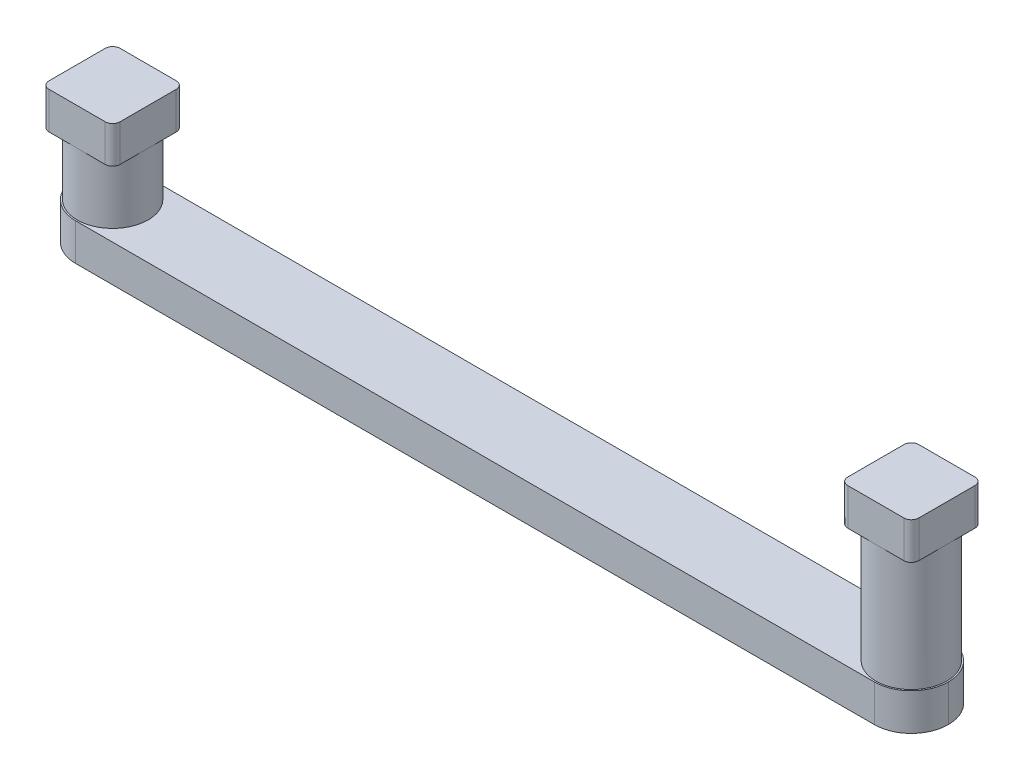
ISO-10303-21;
HEADER;
FILE_DESCRIPTION(('STEP AP214'),'2;1');
FILE_NAME('part.step','',(''),(''),'','','');
FILE_SCHEMA(('AUTOMOTIVE_DESIGN { 1 0 10303 214 1 1 1 1 }'));
ENDSEC;
DATA;
#1=APPLICATION_CONTEXT('core data for automotive mechanical design processes');
#2=APPLICATION_PROTOCOL_DEFINITION('international standard','automotive_design',2000,#1);
#3=PRODUCT_CONTEXT('',#1,'mechanical');
#4=PRODUCT('Part','Part','',(#3));
#5=PRODUCT_RELATED_PRODUCT_CATEGORY('part','',(#4));
#6=PRODUCT_DEFINITION_FORMATION('','',#4);
#7=PRODUCT_DEFINITION_CONTEXT('part definition',#1,'design');
#8=PRODUCT_DEFINITION('design','',#6,#7);
#9=PRODUCT_DEFINITION_SHAPE('','',#8);
#10=(LENGTH_UNIT() NAMED_UNIT(*) SI_UNIT(.MILLI.,.METRE.));
#11=(NAMED_UNIT(*) PLANE_ANGLE_UNIT() SI_UNIT($,.RADIAN.));
#12=(NAMED_UNIT(*) SI_UNIT($,.STERADIAN.) SOLID_ANGLE_UNIT());
#13=UNCERTAINTY_MEASURE_WITH_UNIT(LENGTH_MEASURE(1.E-05),#10,'distance_accuracy_value','');
#14=(GEOMETRIC_REPRESENTATION_CONTEXT(3) GLOBAL_UNCERTAINTY_ASSIGNED_CONTEXT((#13)) GLOBAL_UNIT_ASSIGNED_CONTEXT((#10,
#11,#12)) REPRESENTATION_CONTEXT('',''));
#15=CARTESIAN_POINT('',(0.,0.,0.));
#16=DIRECTION('',(0.,0.,1.));
#17=DIRECTION('',(1.,0.,0.));
#18=AXIS2_PLACEMENT_3D('',#15,#16,#17);
#19=CARTESIAN_POINT('',(37.465,3.175,3.17499999999999));
#20=DIRECTION('',(0.,0.,-1.));
#21=DIRECTION('',(-1.,0.,0.));
#22=AXIS2_PLACEMENT_3D('',#19,#20,#21);
#23=PLANE('',#22);
#24=DIRECTION('',(1.,0.,0.));
#25=VECTOR('',#24,1.);
#26=CARTESIAN_POINT('',(37.465,3.175,3.17499999999999));
#27=LINE('',#26,#25);
#28=CARTESIAN_POINT('',(-34.29,3.175,3.175));
#29=VERTEX_POINT('',#28);
#30=CARTESIAN_POINT('',(34.29,3.175,3.175));
#31=VERTEX_POINT('',#30);
#32=EDGE_CURVE('E285',#29,#31,#27,.T.);
#33=ORIENTED_EDGE('',*,*,#32,.F.);
#34=DIRECTION('',(0.,-1.,0.));
#35=VECTOR('',#34,1.);
#36=CARTESIAN_POINT('',(-34.29,3.175,3.175));
#37=LINE('',#36,#35);
#38=CARTESIAN_POINT('',(-34.29,0.,3.175));
#39=VERTEX_POINT('',#38);
#40=EDGE_CURVE('E365',#29,#39,#37,.T.);
#41=ORIENTED_EDGE('',*,*,#40,.T.);
#42=DIRECTION('',(1.,0.,0.));
#43=VECTOR('',#42,1.);
#44=CARTESIAN_POINT('',(37.465,0.,3.17499999999999));
#45=LINE('',#44,#43);
#46=CARTESIAN_POINT('',(34.29,0.,3.175));
#47=VERTEX_POINT('',#46);
#48=EDGE_CURVE('E280',#39,#47,#45,.T.);
#49=ORIENTED_EDGE('',*,*,#48,.T.);
#50=DIRECTION('',(0.,-1.,0.));
#51=VECTOR('',#50,1.);
#52=CARTESIAN_POINT('',(34.29,3.175,3.175));
#53=LINE('',#52,#51);
#54=EDGE_CURVE('E363',#47,#31,#53,.F.);
#55=ORIENTED_EDGE('',*,*,#54,.T.);
#56=EDGE_LOOP('',(#33,#41,#49,#55));
#57=FACE_BOUND('',#56,.T.);
#58=ADVANCED_FACE('F33',(#57),#23,.F.);
#59=CARTESIAN_POINT('',(37.465,3.175,-3.175));
#60=DIRECTION('',(0.,0.,1.));
#61=DIRECTION('',(1.,0.,0.));
#62=AXIS2_PLACEMENT_3D('',#59,#60,#61);
#63=PLANE('',#62);
#64=DIRECTION('',(-1.,0.,0.));
#65=VECTOR('',#64,1.);
#66=CARTESIAN_POINT('',(37.465,0.,-3.175));
#67=LINE('',#66,#65);
#68=CARTESIAN_POINT('',(34.29,0.,-3.175));
#69=VERTEX_POINT('',#68);
#70=CARTESIAN_POINT('',(-34.29,0.,-3.175));
#71=VERTEX_POINT('',#70);
#72=EDGE_CURVE('E289',#69,#71,#67,.T.);
#73=ORIENTED_EDGE('',*,*,#72,.T.);
#74=DIRECTION('',(0.,-1.,0.));
#75=VECTOR('',#74,1.);
#76=CARTESIAN_POINT('',(-34.29,3.175,-3.175));
#77=LINE('',#76,#75);
#78=CARTESIAN_POINT('',(-34.29,3.175,-3.175));
#79=VERTEX_POINT('',#78);
#80=EDGE_CURVE('E11',#71,#79,#77,.F.);
#81=ORIENTED_EDGE('',*,*,#80,.T.);
#82=DIRECTION('',(-1.,0.,0.));
#83=VECTOR('',#82,1.);
#84=CARTESIAN_POINT('',(37.465,3.175,-3.175));
#85=LINE('',#84,#83);
#86=CARTESIAN_POINT('',(34.29,3.175,-3.175));
#87=VERTEX_POINT('',#86);
#88=EDGE_CURVE('E288',#87,#79,#85,.T.);
#89=ORIENTED_EDGE('',*,*,#88,.F.);
#90=DIRECTION('',(0.,-1.,0.));
#91=VECTOR('',#90,1.);
#92=CARTESIAN_POINT('',(34.29,3.175,-3.175));
#93=LINE('',#92,#91);
#94=EDGE_CURVE('E42',#87,#69,#93,.T.);
#95=ORIENTED_EDGE('',*,*,#94,.T.);
#96=EDGE_LOOP('',(#73,#81,#89,#95));
#97=FACE_BOUND('',#96,.T.);
#98=ADVANCED_FACE('F415',(#97),#63,.F.);
#99=CARTESIAN_POINT('',(0.,3.175,0.));
#100=DIRECTION('',(0.,1.,0.));
#101=DIRECTION('',(0.,0.,1.));
#102=AXIS2_PLACEMENT_3D('',#99,#100,#101);
#103=PLANE('',#102);
#104=CARTESIAN_POINT('',(34.29,3.175,0.));
#105=DIRECTION('',(0.,1.,0.));
#106=DIRECTION('',(0.,0.,1.));
#107=AXIS2_PLACEMENT_3D('',#104,#105,#106);
#108=CIRCLE('',#107,3.048);
#109=CARTESIAN_POINT('',(34.29,3.175,3.048));
#110=VERTEX_POINT('',#109);
#111=EDGE_CURVE('E243',#110,#110,#108,.T.);
#112=ORIENTED_EDGE('',*,*,#111,.F.);
#113=EDGE_LOOP('',(#112));
#114=FACE_BOUND('',#113,.T.);
#115=CARTESIAN_POINT('',(-34.29,3.175,0.));
#116=DIRECTION('',(0.,1.,0.));
#117=DIRECTION('',(0.,0.,1.));
#118=AXIS2_PLACEMENT_3D('',#115,#116,#117);
#119=CIRCLE('',#118,3.048);
#120=CARTESIAN_POINT('',(-34.29,3.175,3.04800000000001));
#121=VERTEX_POINT('',#120);
#122=EDGE_CURVE('E266',#121,#121,#119,.T.);
#123=ORIENTED_EDGE('',*,*,#122,.F.);
#124=EDGE_LOOP('',(#123));
#125=FACE_BOUND('',#124,.T.);
#126=CARTESIAN_POINT('',(-34.29,3.175,0.));
#127=DIRECTION('',(0.,1.,0.));
#128=DIRECTION('',(0.,0.,1.));
#129=AXIS2_PLACEMENT_3D('',#126,#127,#128);
#130=CIRCLE('',#129,3.175);
#131=CARTESIAN_POINT('',(-37.465,3.175,0.));
#132=VERTEX_POINT('',#131);
#133=EDGE_CURVE('E379',#79,#132,#130,.T.);
#134=ORIENTED_EDGE('',*,*,#133,.T.);
#135=CARTESIAN_POINT('',(-34.29,3.175,0.));
#136=DIRECTION('',(0.,1.,0.));
#137=DIRECTION('',(0.,0.,1.));
#138=AXIS2_PLACEMENT_3D('',#135,#136,#137);
#139=CIRCLE('',#138,3.175);
#140=EDGE_CURVE('E381',#132,#29,#139,.T.);
#141=ORIENTED_EDGE('',*,*,#140,.T.);
#142=ORIENTED_EDGE('',*,*,#32,.T.);
#143=CARTESIAN_POINT('',(34.29,3.175,0.));
#144=DIRECTION('',(0.,1.,0.));
#145=DIRECTION('',(0.,0.,1.));
#146=AXIS2_PLACEMENT_3D('',#143,#144,#145);
#147=CIRCLE('',#146,3.175);
#148=CARTESIAN_POINT('',(37.465,3.175,0.));
#149=VERTEX_POINT('',#148);
#150=EDGE_CURVE('E376',#31,#149,#147,.T.);
#151=ORIENTED_EDGE('',*,*,#150,.T.);
#152=CARTESIAN_POINT('',(34.29,3.175,0.));
#153=DIRECTION('',(0.,1.,0.));
#154=DIRECTION('',(0.,0.,1.));
#155=AXIS2_PLACEMENT_3D('',#152,#153,#154);
#156=CIRCLE('',#155,3.175);
#157=EDGE_CURVE('E55',#149,#87,#156,.T.);
#158=ORIENTED_EDGE('',*,*,#157,.T.);
#159=ORIENTED_EDGE('',*,*,#88,.T.);
#160=EDGE_LOOP('',(#134,#141,#142,#151,#158,#159));
#161=FACE_BOUND('',#160,.T.);
#162=ADVANCED_FACE('F414',(#114,#125,#161),#103,.T.);
#163=CARTESIAN_POINT('',(0.,0.,0.));
#164=DIRECTION('',(0.,1.,0.));
#165=DIRECTION('',(0.,0.,1.));
#166=AXIS2_PLACEMENT_3D('',#163,#164,#165);
#167=PLANE('',#166);
#168=ORIENTED_EDGE('',*,*,#48,.F.);
#169=CARTESIAN_POINT('',(-34.29,0.,0.));
#170=DIRECTION('',(0.,1.,0.));
#171=DIRECTION('',(0.,0.,1.));
#172=AXIS2_PLACEMENT_3D('',#169,#170,#171);
#173=CIRCLE('',#172,3.175);
#174=CARTESIAN_POINT('',(-37.465,0.,0.));
#175=VERTEX_POINT('',#174);
#176=EDGE_CURVE('E374',#39,#175,#173,.F.);
#177=ORIENTED_EDGE('',*,*,#176,.T.);
#178=CARTESIAN_POINT('',(-34.29,0.,0.));
#179=DIRECTION('',(0.,1.,0.));
#180=DIRECTION('',(0.,0.,1.));
#181=AXIS2_PLACEMENT_3D('',#178,#179,#180);
#182=CIRCLE('',#181,3.175);
#183=EDGE_CURVE('E372',#175,#71,#182,.F.);
#184=ORIENTED_EDGE('',*,*,#183,.T.);
#185=ORIENTED_EDGE('',*,*,#72,.F.);
#186=CARTESIAN_POINT('',(34.29,0.,0.));
#187=DIRECTION('',(0.,1.,0.));
#188=DIRECTION('',(0.,0.,1.));
#189=AXIS2_PLACEMENT_3D('',#186,#187,#188);
#190=CIRCLE('',#189,3.175);
#191=CARTESIAN_POINT('',(37.465,0.,0.));
#192=VERTEX_POINT('',#191);
#193=EDGE_CURVE('E370',#69,#192,#190,.F.);
#194=ORIENTED_EDGE('',*,*,#193,.T.);
#195=CARTESIAN_POINT('',(34.29,0.,0.));
#196=DIRECTION('',(0.,1.,0.));
#197=DIRECTION('',(0.,0.,1.));
#198=AXIS2_PLACEMENT_3D('',#195,#196,#197);
#199=CIRCLE('',#198,3.175);
#200=EDGE_CURVE('E368',#192,#47,#199,.F.);
#201=ORIENTED_EDGE('',*,*,#200,.T.);
#202=EDGE_LOOP('',(#168,#177,#184,#185,#194,#201));
#203=FACE_BOUND('',#202,.T.);
#204=ADVANCED_FACE('F404',(#203),#167,.F.);
#205=CARTESIAN_POINT('',(-34.29,8.509,0.));
#206=DIRECTION('',(0.,-1.,0.));
#207=DIRECTION('',(0.,0.,-1.));
#208=AXIS2_PLACEMENT_3D('',#205,#206,#207);
#209=CYLINDRICAL_SURFACE('',#208,3.048);
#210=CARTESIAN_POINT('',(-34.29,8.509,0.));
#211=DIRECTION('',(0.,1.,0.));
#212=DIRECTION('',(0.,0.,1.));
#213=AXIS2_PLACEMENT_3D('',#210,#211,#212);
#214=CIRCLE('',#213,3.048);
#215=CARTESIAN_POINT('',(-34.29,8.509,3.04800000000001));
#216=VERTEX_POINT('',#215);
#217=CARTESIAN_POINT('',(-31.242,8.509,0.));
#218=VERTEX_POINT('',#217);
#219=EDGE_CURVE('E277',#216,#218,#214,.T.);
#220=ORIENTED_EDGE('',*,*,#219,.F.);
#221=CARTESIAN_POINT('',(-37.338,8.509,0.));
#222=VERTEX_POINT('',#221);
#223=EDGE_CURVE('E282',#222,#216,#214,.T.);
#224=ORIENTED_EDGE('',*,*,#223,.F.);
#225=CARTESIAN_POINT('',(-34.29,8.509,-3.048));
#226=VERTEX_POINT('',#225);
#227=EDGE_CURVE('E761',#226,#222,#214,.T.);
#228=ORIENTED_EDGE('',*,*,#227,.F.);
#229=EDGE_CURVE('E281',#218,#226,#214,.T.);
#230=ORIENTED_EDGE('',*,*,#229,.F.);
#231=EDGE_LOOP('',(#220,#224,#228,#230));
#232=FACE_BOUND('',#231,.T.);
#233=ORIENTED_EDGE('',*,*,#122,.T.);
#234=EDGE_LOOP('',(#233));
#235=FACE_BOUND('',#234,.T.);
#236=ADVANCED_FACE('F649',(#232,#235),#209,.T.);
#237=CARTESIAN_POINT('',(0.,8.509,0.));
#238=DIRECTION('',(0.,1.,0.));
#239=DIRECTION('',(0.,0.,1.));
#240=AXIS2_PLACEMENT_3D('',#237,#238,#239);
#241=PLANE('',#240);
#242=DIRECTION('',(0.,0.,-1.));
#243=VECTOR('',#242,1.);
#244=CARTESIAN_POINT('',(-31.242,8.509,3.04800000000001));
#245=LINE('',#244,#243);
#246=CARTESIAN_POINT('',(-31.242,8.509,2.41300000000001));
#247=VERTEX_POINT('',#246);
#248=EDGE_CURVE('E273',#247,#218,#245,.T.);
#249=ORIENTED_EDGE('',*,*,#248,.F.);
#250=CARTESIAN_POINT('',(-31.877,8.509,2.41300000000001));
#251=DIRECTION('',(0.,1.,0.));
#252=DIRECTION('',(0.,0.,1.));
#253=AXIS2_PLACEMENT_3D('',#250,#251,#252);
#254=CIRCLE('',#253,0.635);
#255=CARTESIAN_POINT('',(-31.877,8.509,3.04800000000001));
#256=VERTEX_POINT('',#255);
#257=EDGE_CURVE('E352',#247,#256,#254,.F.);
#258=ORIENTED_EDGE('',*,*,#257,.T.);
#259=DIRECTION('',(1.,0.,0.));
#260=VECTOR('',#259,1.);
#261=CARTESIAN_POINT('',(-31.242,8.509,3.04800000000001));
#262=LINE('',#261,#260);
#263=EDGE_CURVE('E269',#216,#256,#262,.T.);
#264=ORIENTED_EDGE('',*,*,#263,.F.);
#265=ORIENTED_EDGE('',*,*,#219,.T.);
#266=EDGE_LOOP('',(#249,#258,#264,#265));
#267=FACE_BOUND('',#266,.T.);
#268=ADVANCED_FACE('F631',(#267),#241,.F.);
#269=DIRECTION('',(-1.,0.,0.));
#270=VECTOR('',#269,1.);
#271=CARTESIAN_POINT('',(-31.242,8.509,-3.048));
#272=LINE('',#271,#270);
#273=CARTESIAN_POINT('',(-31.877,8.509,-3.048));
#274=VERTEX_POINT('',#273);
#275=EDGE_CURVE('E257',#274,#226,#272,.T.);
#276=ORIENTED_EDGE('',*,*,#275,.F.);
#277=CARTESIAN_POINT('',(-31.877,8.509,-2.413));
#278=DIRECTION('',(0.,1.,0.));
#279=DIRECTION('',(0.,0.,1.));
#280=AXIS2_PLACEMENT_3D('',#277,#278,#279);
#281=CIRCLE('',#280,0.635);
#282=CARTESIAN_POINT('',(-31.242,8.509,-2.413));
#283=VERTEX_POINT('',#282);
#284=EDGE_CURVE('E361',#274,#283,#281,.F.);
#285=ORIENTED_EDGE('',*,*,#284,.T.);
#286=EDGE_CURVE('E272',#218,#283,#245,.T.);
#287=ORIENTED_EDGE('',*,*,#286,.F.);
#288=ORIENTED_EDGE('',*,*,#229,.T.);
#289=EDGE_LOOP('',(#276,#285,#287,#288));
#290=FACE_BOUND('',#289,.T.);
#291=ADVANCED_FACE('F637',(#290),#241,.F.);
#292=DIRECTION('',(0.,0.,1.));
#293=VECTOR('',#292,1.);
#294=CARTESIAN_POINT('',(-37.338,8.509,3.04800000000001));
#295=LINE('',#294,#293);
#296=CARTESIAN_POINT('',(-37.338,8.509,-2.413));
#297=VERTEX_POINT('',#296);
#298=EDGE_CURVE('E267',#297,#222,#295,.T.);
#299=ORIENTED_EDGE('',*,*,#298,.F.);
#300=CARTESIAN_POINT('',(-36.703,8.509,-2.413));
#301=DIRECTION('',(0.,1.,0.));
#302=DIRECTION('',(0.,0.,1.));
#303=AXIS2_PLACEMENT_3D('',#300,#301,#302);
#304=CIRCLE('',#303,0.635);
#305=CARTESIAN_POINT('',(-36.703,8.509,-3.048));
#306=VERTEX_POINT('',#305);
#307=EDGE_CURVE('E354',#297,#306,#304,.F.);
#308=ORIENTED_EDGE('',*,*,#307,.T.);
#309=EDGE_CURVE('E275',#226,#306,#272,.T.);
#310=ORIENTED_EDGE('',*,*,#309,.F.);
#311=ORIENTED_EDGE('',*,*,#227,.T.);
#312=EDGE_LOOP('',(#299,#308,#310,#311));
#313=FACE_BOUND('',#312,.T.);
#314=ADVANCED_FACE('F628',(#313),#241,.F.);
#315=CARTESIAN_POINT('',(-36.703,8.509,3.04800000000001));
#316=VERTEX_POINT('',#315);
#317=EDGE_CURVE('E270',#316,#216,#262,.T.);
#318=ORIENTED_EDGE('',*,*,#317,.F.);
#319=CARTESIAN_POINT('',(-36.703,8.509,2.41300000000001));
#320=DIRECTION('',(0.,1.,0.));
#321=DIRECTION('',(0.,0.,1.));
#322=AXIS2_PLACEMENT_3D('',#319,#320,#321);
#323=CIRCLE('',#322,0.635);
#324=CARTESIAN_POINT('',(-37.338,8.509,2.41300000000001));
#325=VERTEX_POINT('',#324);
#326=EDGE_CURVE('E332',#316,#325,#323,.F.);
#327=ORIENTED_EDGE('',*,*,#326,.T.);
#328=EDGE_CURVE('E236',#222,#325,#295,.T.);
#329=ORIENTED_EDGE('',*,*,#328,.F.);
#330=ORIENTED_EDGE('',*,*,#223,.T.);
#331=EDGE_LOOP('',(#318,#327,#329,#330));
#332=FACE_BOUND('',#331,.T.);
#333=ADVANCED_FACE('F620',(#332),#241,.F.);
#334=CARTESIAN_POINT('',(-37.338,11.684,3.04800000000001));
#335=DIRECTION('',(1.,0.,0.));
#336=DIRECTION('',(0.,0.,-1.));
#337=AXIS2_PLACEMENT_3D('',#334,#335,#336);
#338=PLANE('',#337);
#339=ORIENTED_EDGE('',*,*,#328,.T.);
#340=DIRECTION('',(0.,-1.,0.));
#341=VECTOR('',#340,1.);
#342=CARTESIAN_POINT('',(-37.338,11.684,2.41300000000001));
#343=LINE('',#342,#341);
#344=CARTESIAN_POINT('',(-37.338,11.684,2.41300000000001));
#345=VERTEX_POINT('',#344);
#346=EDGE_CURVE('E337',#325,#345,#343,.F.);
#347=ORIENTED_EDGE('',*,*,#346,.T.);
#348=DIRECTION('',(0.,0.,1.));
#349=VECTOR('',#348,1.);
#350=CARTESIAN_POINT('',(-37.338,11.684,3.04800000000001));
#351=LINE('',#350,#349);
#352=CARTESIAN_POINT('',(-37.338,11.684,-2.413));
#353=VERTEX_POINT('',#352);
#354=EDGE_CURVE('E253',#353,#345,#351,.T.);
#355=ORIENTED_EDGE('',*,*,#354,.F.);
#356=DIRECTION('',(0.,-1.,0.));
#357=VECTOR('',#356,1.);
#358=CARTESIAN_POINT('',(-37.338,11.684,-2.413));
#359=LINE('',#358,#357);
#360=EDGE_CURVE('E334',#353,#297,#359,.T.);
#361=ORIENTED_EDGE('',*,*,#360,.T.);
#362=ORIENTED_EDGE('',*,*,#298,.T.);
#363=EDGE_LOOP('',(#339,#347,#355,#361,#362));
#364=FACE_BOUND('',#363,.T.);
#365=ADVANCED_FACE('F612',(#364),#338,.F.);
#366=CARTESIAN_POINT('',(-31.242,11.684,3.04800000000001));
#367=DIRECTION('',(0.,0.,-1.));
#368=DIRECTION('',(-1.,0.,0.));
#369=AXIS2_PLACEMENT_3D('',#366,#367,#368);
#370=PLANE('',#369);
#371=DIRECTION('',(1.,0.,0.));
#372=VECTOR('',#371,1.);
#373=CARTESIAN_POINT('',(-31.242,11.684,3.04800000000001));
#374=LINE('',#373,#372);
#375=CARTESIAN_POINT('',(-36.703,11.684,3.04800000000001));
#376=VERTEX_POINT('',#375);
#377=CARTESIAN_POINT('',(-31.877,11.684,3.04800000000001));
#378=VERTEX_POINT('',#377);
#379=EDGE_CURVE('E256',#376,#378,#374,.T.);
#380=ORIENTED_EDGE('',*,*,#379,.F.);
#381=DIRECTION('',(0.,-1.,0.));
#382=VECTOR('',#381,1.);
#383=CARTESIAN_POINT('',(-36.703,11.684,3.04800000000001));
#384=LINE('',#383,#382);
#385=EDGE_CURVE('E329',#376,#316,#384,.T.);
#386=ORIENTED_EDGE('',*,*,#385,.T.);
#387=ORIENTED_EDGE('',*,*,#317,.T.);
#388=ORIENTED_EDGE('',*,*,#263,.T.);
#389=DIRECTION('',(0.,-1.,0.));
#390=VECTOR('',#389,1.);
#391=CARTESIAN_POINT('',(-31.877,11.684,3.04800000000001));
#392=LINE('',#391,#390);
#393=EDGE_CURVE('E327',#256,#378,#392,.F.);
#394=ORIENTED_EDGE('',*,*,#393,.T.);
#395=EDGE_LOOP('',(#380,#386,#387,#388,#394));
#396=FACE_BOUND('',#395,.T.);
#397=ADVANCED_FACE('F604',(#396),#370,.F.);
#398=CARTESIAN_POINT('',(-31.242,11.684,3.04800000000001));
#399=DIRECTION('',(-1.,0.,0.));
#400=DIRECTION('',(0.,0.,1.));
#401=AXIS2_PLACEMENT_3D('',#398,#399,#400);
#402=PLANE('',#401);
#403=DIRECTION('',(0.,0.,-1.));
#404=VECTOR('',#403,1.);
#405=CARTESIAN_POINT('',(-31.242,11.684,3.04800000000001));
#406=LINE('',#405,#404);
#407=CARTESIAN_POINT('',(-31.242,11.684,2.41300000000001));
#408=VERTEX_POINT('',#407);
#409=CARTESIAN_POINT('',(-31.242,11.684,-2.413));
#410=VERTEX_POINT('',#409);
#411=EDGE_CURVE('E260',#408,#410,#406,.T.);
#412=ORIENTED_EDGE('',*,*,#411,.F.);
#413=DIRECTION('',(0.,-1.,0.));
#414=VECTOR('',#413,1.);
#415=CARTESIAN_POINT('',(-31.242,11.684,2.41300000000001));
#416=LINE('',#415,#414);
#417=EDGE_CURVE('E349',#408,#247,#416,.T.);
#418=ORIENTED_EDGE('',*,*,#417,.T.);
#419=ORIENTED_EDGE('',*,*,#248,.T.);
#420=ORIENTED_EDGE('',*,*,#286,.T.);
#421=DIRECTION('',(0.,-1.,0.));
#422=VECTOR('',#421,1.);
#423=CARTESIAN_POINT('',(-31.242,11.684,-2.413));
#424=LINE('',#423,#422);
#425=EDGE_CURVE('E347',#283,#410,#424,.F.);
#426=ORIENTED_EDGE('',*,*,#425,.T.);
#427=EDGE_LOOP('',(#412,#418,#419,#420,#426));
#428=FACE_BOUND('',#427,.T.);
#429=ADVANCED_FACE('F596',(#428),#402,.F.);
#430=CARTESIAN_POINT('',(-31.242,11.684,-3.048));
#431=DIRECTION('',(0.,0.,1.));
#432=DIRECTION('',(1.,0.,0.));
#433=AXIS2_PLACEMENT_3D('',#430,#431,#432);
#434=PLANE('',#433);
#435=ORIENTED_EDGE('',*,*,#309,.T.);
#436=DIRECTION('',(0.,-1.,0.));
#437=VECTOR('',#436,1.);
#438=CARTESIAN_POINT('',(-36.703,11.684,-3.048));
#439=LINE('',#438,#437);
#440=CARTESIAN_POINT('',(-36.703,11.684,-3.048));
#441=VERTEX_POINT('',#440);
#442=EDGE_CURVE('E359',#306,#441,#439,.F.);
#443=ORIENTED_EDGE('',*,*,#442,.T.);
#444=DIRECTION('',(-1.,0.,0.));
#445=VECTOR('',#444,1.);
#446=CARTESIAN_POINT('',(-31.242,11.684,-3.048));
#447=LINE('',#446,#445);
#448=CARTESIAN_POINT('',(-31.877,11.684,-3.048));
#449=VERTEX_POINT('',#448);
#450=EDGE_CURVE('E263',#449,#441,#447,.T.);
#451=ORIENTED_EDGE('',*,*,#450,.F.);
#452=DIRECTION('',(0.,-1.,0.));
#453=VECTOR('',#452,1.);
#454=CARTESIAN_POINT('',(-31.877,11.684,-3.048));
#455=LINE('',#454,#453);
#456=EDGE_CURVE('E356',#449,#274,#455,.T.);
#457=ORIENTED_EDGE('',*,*,#456,.T.);
#458=ORIENTED_EDGE('',*,*,#275,.T.);
#459=EDGE_LOOP('',(#435,#443,#451,#457,#458));
#460=FACE_BOUND('',#459,.T.);
#461=ADVANCED_FACE('F588',(#460),#434,.F.);
#462=CARTESIAN_POINT('',(0.,11.684,0.));
#463=DIRECTION('',(0.,1.,0.));
#464=DIRECTION('',(0.,0.,1.));
#465=AXIS2_PLACEMENT_3D('',#462,#463,#464);
#466=PLANE('',#465);
#467=ORIENTED_EDGE('',*,*,#354,.T.);
#468=CARTESIAN_POINT('',(-36.703,11.684,2.41300000000001));
#469=DIRECTION('',(0.,1.,0.));
#470=DIRECTION('',(0.,0.,1.));
#471=AXIS2_PLACEMENT_3D('',#468,#469,#470);
#472=CIRCLE('',#471,0.635);
#473=EDGE_CURVE('E345',#345,#376,#472,.T.);
#474=ORIENTED_EDGE('',*,*,#473,.T.);
#475=ORIENTED_EDGE('',*,*,#379,.T.);
#476=CARTESIAN_POINT('',(-31.877,11.684,2.41300000000001));
#477=DIRECTION('',(0.,1.,0.));
#478=DIRECTION('',(0.,0.,1.));
#479=AXIS2_PLACEMENT_3D('',#476,#477,#478);
#480=CIRCLE('',#479,0.635);
#481=EDGE_CURVE('E343',#378,#408,#480,.T.);
#482=ORIENTED_EDGE('',*,*,#481,.T.);
#483=ORIENTED_EDGE('',*,*,#411,.T.);
#484=CARTESIAN_POINT('',(-31.877,11.684,-2.413));
#485=DIRECTION('',(0.,1.,0.));
#486=DIRECTION('',(0.,0.,1.));
#487=AXIS2_PLACEMENT_3D('',#484,#485,#486);
#488=CIRCLE('',#487,0.635);
#489=EDGE_CURVE('E339',#410,#449,#488,.T.);
#490=ORIENTED_EDGE('',*,*,#489,.T.);
#491=ORIENTED_EDGE('',*,*,#450,.T.);
#492=CARTESIAN_POINT('',(-36.703,11.684,-2.413));
#493=DIRECTION('',(0.,1.,0.));
#494=DIRECTION('',(0.,0.,1.));
#495=AXIS2_PLACEMENT_3D('',#492,#493,#494);
#496=CIRCLE('',#495,0.635);
#497=EDGE_CURVE('E341',#441,#353,#496,.T.);
#498=ORIENTED_EDGE('',*,*,#497,.T.);
#499=EDGE_LOOP('',(#467,#474,#475,#482,#483,#490,#491,#498));
#500=FACE_BOUND('',#499,.T.);
#501=ADVANCED_FACE('F580',(#500),#466,.T.);
#502=CARTESIAN_POINT('',(34.29,13.335,0.));
#503=DIRECTION('',(0.,-1.,0.));
#504=DIRECTION('',(0.,0.,-1.));
#505=AXIS2_PLACEMENT_3D('',#502,#503,#504);
#506=CYLINDRICAL_SURFACE('',#505,3.048);
#507=CARTESIAN_POINT('',(34.29,13.335,0.));
#508=DIRECTION('',(0.,1.,0.));
#509=DIRECTION('',(0.,0.,1.));
#510=AXIS2_PLACEMENT_3D('',#507,#508,#509);
#511=CIRCLE('',#510,3.048);
#512=CARTESIAN_POINT('',(34.29,13.335,3.048));
#513=VERTEX_POINT('',#512);
#514=CARTESIAN_POINT('',(37.338,13.335,0.));
#515=VERTEX_POINT('',#514);
#516=EDGE_CURVE('E225',#513,#515,#511,.T.);
#517=ORIENTED_EDGE('',*,*,#516,.F.);
#518=CARTESIAN_POINT('',(31.242,13.335,0.));
#519=VERTEX_POINT('',#518);
#520=EDGE_CURVE('E229',#519,#513,#511,.T.);
#521=ORIENTED_EDGE('',*,*,#520,.F.);
#522=CARTESIAN_POINT('',(34.29,13.335,-3.048));
#523=VERTEX_POINT('',#522);
#524=EDGE_CURVE('E242',#523,#519,#511,.T.);
#525=ORIENTED_EDGE('',*,*,#524,.F.);
#526=EDGE_CURVE('E232',#515,#523,#511,.T.);
#527=ORIENTED_EDGE('',*,*,#526,.F.);
#528=EDGE_LOOP('',(#517,#521,#525,#527));
#529=FACE_BOUND('',#528,.T.);
#530=ORIENTED_EDGE('',*,*,#111,.T.);
#531=EDGE_LOOP('',(#530));
#532=FACE_BOUND('',#531,.T.);
#533=ADVANCED_FACE('F226',(#529,#532),#506,.T.);
#534=CARTESIAN_POINT('',(0.,13.335,0.));
#535=DIRECTION('',(0.,-1.,0.));
#536=DIRECTION('',(0.,0.,-1.));
#537=AXIS2_PLACEMENT_3D('',#534,#535,#536);
#538=PLANE('',#537);
#539=DIRECTION('',(0.,0.,-1.));
#540=VECTOR('',#539,1.);
#541=CARTESIAN_POINT('',(37.338,13.335,3.048));
#542=LINE('',#541,#540);
#543=CARTESIAN_POINT('',(37.338,13.335,2.413));
#544=VERTEX_POINT('',#543);
#545=EDGE_CURVE('E391',#544,#515,#542,.T.);
#546=ORIENTED_EDGE('',*,*,#545,.F.);
#547=CARTESIAN_POINT('',(36.703,13.335,2.413));
#548=DIRECTION('',(0.,-1.,0.));
#549=DIRECTION('',(0.,0.,-1.));
#550=AXIS2_PLACEMENT_3D('',#547,#548,#549);
#551=CIRCLE('',#550,0.635);
#552=CARTESIAN_POINT('',(36.703,13.335,3.048));
#553=VERTEX_POINT('',#552);
#554=EDGE_CURVE('E245',#544,#553,#551,.T.);
#555=ORIENTED_EDGE('',*,*,#554,.T.);
#556=DIRECTION('',(1.,0.,0.));
#557=VECTOR('',#556,1.);
#558=CARTESIAN_POINT('',(31.242,13.335,3.048));
#559=LINE('',#558,#557);
#560=EDGE_CURVE('E213',#513,#553,#559,.T.);
#561=ORIENTED_EDGE('',*,*,#560,.F.);
#562=ORIENTED_EDGE('',*,*,#516,.T.);
#563=EDGE_LOOP('',(#546,#555,#561,#562));
#564=FACE_BOUND('',#563,.T.);
#565=ADVANCED_FACE('F244',(#564),#538,.T.);
#566=DIRECTION('',(-1.,0.,0.));
#567=VECTOR('',#566,1.);
#568=CARTESIAN_POINT('',(31.242,13.335,-3.048));
#569=LINE('',#568,#567);
#570=CARTESIAN_POINT('',(36.703,13.335,-3.048));
#571=VERTEX_POINT('',#570);
#572=EDGE_CURVE('E785',#571,#523,#569,.T.);
#573=ORIENTED_EDGE('',*,*,#572,.F.);
#574=CARTESIAN_POINT('',(36.703,13.335,-2.413));
#575=DIRECTION('',(0.,-1.,0.));
#576=DIRECTION('',(0.,0.,-1.));
#577=AXIS2_PLACEMENT_3D('',#574,#575,#576);
#578=CIRCLE('',#577,0.635);
#579=CARTESIAN_POINT('',(37.338,13.335,-2.413));
#580=VERTEX_POINT('',#579);
#581=EDGE_CURVE('E319',#571,#580,#578,.T.);
#582=ORIENTED_EDGE('',*,*,#581,.T.);
#583=EDGE_CURVE('E386',#515,#580,#542,.T.);
#584=ORIENTED_EDGE('',*,*,#583,.F.);
#585=ORIENTED_EDGE('',*,*,#526,.T.);
#586=EDGE_LOOP('',(#573,#582,#584,#585));
#587=FACE_BOUND('',#586,.T.);
#588=ADVANCED_FACE('F561',(#587),#538,.T.);
#589=DIRECTION('',(0.,0.,1.));
#590=VECTOR('',#589,1.);
#591=CARTESIAN_POINT('',(31.242,13.335,3.048));
#592=LINE('',#591,#590);
#593=CARTESIAN_POINT('',(31.242,13.335,-2.413));
#594=VERTEX_POINT('',#593);
#595=EDGE_CURVE('E246',#594,#519,#592,.T.);
#596=ORIENTED_EDGE('',*,*,#595,.F.);
#597=CARTESIAN_POINT('',(31.877,13.335,-2.413));
#598=DIRECTION('',(0.,-1.,0.));
#599=DIRECTION('',(0.,0.,-1.));
#600=AXIS2_PLACEMENT_3D('',#597,#598,#599);
#601=CIRCLE('',#600,0.635);
#602=CARTESIAN_POINT('',(31.877,13.335,-3.048));
#603=VERTEX_POINT('',#602);
#604=EDGE_CURVE('E299',#594,#603,#601,.T.);
#605=ORIENTED_EDGE('',*,*,#604,.T.);
#606=EDGE_CURVE('E788',#523,#603,#569,.T.);
#607=ORIENTED_EDGE('',*,*,#606,.F.);
#608=ORIENTED_EDGE('',*,*,#524,.T.);
#609=EDGE_LOOP('',(#596,#605,#607,#608));
#610=FACE_BOUND('',#609,.T.);
#611=ADVANCED_FACE('F518',(#610),#538,.T.);
#612=CARTESIAN_POINT('',(37.338,16.51,3.048));
#613=DIRECTION('',(-1.,0.,0.));
#614=DIRECTION('',(0.,0.,1.));
#615=AXIS2_PLACEMENT_3D('',#612,#613,#614);
#616=PLANE('',#615);
#617=ORIENTED_EDGE('',*,*,#583,.T.);
#618=DIRECTION('',(0.,-1.,0.));
#619=VECTOR('',#618,1.);
#620=CARTESIAN_POINT('',(37.338,16.51,-2.413));
#621=LINE('',#620,#619);
#622=CARTESIAN_POINT('',(37.338,16.51,-2.413));
#623=VERTEX_POINT('',#622);
#624=EDGE_CURVE('E324',#580,#623,#621,.F.);
#625=ORIENTED_EDGE('',*,*,#624,.T.);
#626=DIRECTION('',(0.,0.,-1.));
#627=VECTOR('',#626,1.);
#628=CARTESIAN_POINT('',(37.338,16.51,3.048));
#629=LINE('',#628,#627);
#630=CARTESIAN_POINT('',(37.338,16.51,2.413));
#631=VERTEX_POINT('',#630);
#632=EDGE_CURVE('E219',#631,#623,#629,.T.);
#633=ORIENTED_EDGE('',*,*,#632,.F.);
#634=DIRECTION('',(0.,-1.,0.));
#635=VECTOR('',#634,1.);
#636=CARTESIAN_POINT('',(37.338,16.51,2.413));
#637=LINE('',#636,#635);
#638=EDGE_CURVE('E321',#631,#544,#637,.T.);
#639=ORIENTED_EDGE('',*,*,#638,.T.);
#640=ORIENTED_EDGE('',*,*,#545,.T.);
#641=EDGE_LOOP('',(#617,#625,#633,#639,#640));
#642=FACE_BOUND('',#641,.T.);
#643=ADVANCED_FACE('F546',(#642),#616,.F.);
#644=CARTESIAN_POINT('',(31.242,16.51,-3.048));
#645=DIRECTION('',(0.,0.,1.));
#646=DIRECTION('',(1.,0.,0.));
#647=AXIS2_PLACEMENT_3D('',#644,#645,#646);
#648=PLANE('',#647);
#649=ORIENTED_EDGE('',*,*,#606,.T.);
#650=DIRECTION('',(0.,-1.,0.));
#651=VECTOR('',#650,1.);
#652=CARTESIAN_POINT('',(31.877,16.51,-3.048));
#653=LINE('',#652,#651);
#654=CARTESIAN_POINT('',(31.877,16.51,-3.048));
#655=VERTEX_POINT('',#654);
#656=EDGE_CURVE('E304',#603,#655,#653,.F.);
#657=ORIENTED_EDGE('',*,*,#656,.T.);
#658=DIRECTION('',(-1.,0.,0.));
#659=VECTOR('',#658,1.);
#660=CARTESIAN_POINT('',(31.242,16.51,-3.048));
#661=LINE('',#660,#659);
#662=CARTESIAN_POINT('',(36.703,16.51,-3.048));
#663=VERTEX_POINT('',#662);
#664=EDGE_CURVE('E795',#663,#655,#661,.T.);
#665=ORIENTED_EDGE('',*,*,#664,.F.);
#666=DIRECTION('',(0.,-1.,0.));
#667=VECTOR('',#666,1.);
#668=CARTESIAN_POINT('',(36.703,16.51,-3.048));
#669=LINE('',#668,#667);
#670=EDGE_CURVE('E301',#663,#571,#669,.T.);
#671=ORIENTED_EDGE('',*,*,#670,.T.);
#672=ORIENTED_EDGE('',*,*,#572,.T.);
#673=EDGE_LOOP('',(#649,#657,#665,#671,#672));
#674=FACE_BOUND('',#673,.T.);
#675=ADVANCED_FACE('F538',(#674),#648,.F.);
#676=CARTESIAN_POINT('',(31.242,16.51,3.048));
#677=DIRECTION('',(1.,0.,0.));
#678=DIRECTION('',(0.,0.,-1.));
#679=AXIS2_PLACEMENT_3D('',#676,#677,#678);
#680=PLANE('',#679);
#681=DIRECTION('',(0.,0.,1.));
#682=VECTOR('',#681,1.);
#683=CARTESIAN_POINT('',(31.242,16.51,3.048));
#684=LINE('',#683,#682);
#685=CARTESIAN_POINT('',(31.242,16.51,-2.413));
#686=VERTEX_POINT('',#685);
#687=CARTESIAN_POINT('',(31.242,16.51,2.413));
#688=VERTEX_POINT('',#687);
#689=EDGE_CURVE('E792',#686,#688,#684,.T.);
#690=ORIENTED_EDGE('',*,*,#689,.F.);
#691=DIRECTION('',(0.,-1.,0.));
#692=VECTOR('',#691,1.);
#693=CARTESIAN_POINT('',(31.242,16.51,-2.413));
#694=LINE('',#693,#692);
#695=EDGE_CURVE('E296',#686,#594,#694,.T.);
#696=ORIENTED_EDGE('',*,*,#695,.T.);
#697=ORIENTED_EDGE('',*,*,#595,.T.);
#698=CARTESIAN_POINT('',(31.242,13.335,2.413));
#699=VERTEX_POINT('',#698);
#700=EDGE_CURVE('E241',#519,#699,#592,.T.);
#701=ORIENTED_EDGE('',*,*,#700,.T.);
#702=DIRECTION('',(0.,-1.,0.));
#703=VECTOR('',#702,1.);
#704=CARTESIAN_POINT('',(31.242,16.51,2.413));
#705=LINE('',#704,#703);
#706=EDGE_CURVE('E291',#699,#688,#705,.F.);
#707=ORIENTED_EDGE('',*,*,#706,.T.);
#708=EDGE_LOOP('',(#690,#696,#697,#701,#707));
#709=FACE_BOUND('',#708,.T.);
#710=ADVANCED_FACE('F531',(#709),#680,.F.);
#711=CARTESIAN_POINT('',(31.242,16.51,3.048));
#712=DIRECTION('',(0.,0.,-1.));
#713=DIRECTION('',(-1.,0.,0.));
#714=AXIS2_PLACEMENT_3D('',#711,#712,#713);
#715=PLANE('',#714);
#716=DIRECTION('',(1.,0.,0.));
#717=VECTOR('',#716,1.);
#718=CARTESIAN_POINT('',(31.242,16.51,3.048));
#719=LINE('',#718,#717);
#720=CARTESIAN_POINT('',(31.877,16.51,3.048));
#721=VERTEX_POINT('',#720);
#722=CARTESIAN_POINT('',(36.703,16.51,3.048));
#723=VERTEX_POINT('',#722);
#724=EDGE_CURVE('E252',#721,#723,#719,.T.);
#725=ORIENTED_EDGE('',*,*,#724,.F.);
#726=DIRECTION('',(0.,-1.,0.));
#727=VECTOR('',#726,1.);
#728=CARTESIAN_POINT('',(31.877,16.51,3.048));
#729=LINE('',#728,#727);
#730=CARTESIAN_POINT('',(31.877,13.335,3.048));
#731=VERTEX_POINT('',#730);
#732=EDGE_CURVE('E216',#721,#731,#729,.T.);
#733=ORIENTED_EDGE('',*,*,#732,.T.);
#734=EDGE_CURVE('E208',#731,#513,#559,.T.);
#735=ORIENTED_EDGE('',*,*,#734,.T.);
#736=ORIENTED_EDGE('',*,*,#560,.T.);
#737=DIRECTION('',(0.,-1.,0.));
#738=VECTOR('',#737,1.);
#739=CARTESIAN_POINT('',(36.703,16.51,3.048));
#740=LINE('',#739,#738);
#741=EDGE_CURVE('E314',#553,#723,#740,.F.);
#742=ORIENTED_EDGE('',*,*,#741,.T.);
#743=EDGE_LOOP('',(#725,#733,#735,#736,#742));
#744=FACE_BOUND('',#743,.T.);
#745=ADVANCED_FACE('F211',(#744),#715,.F.);
#746=CARTESIAN_POINT('',(0.,16.51,0.));
#747=DIRECTION('',(0.,-1.,0.));
#748=DIRECTION('',(0.,0.,-1.));
#749=AXIS2_PLACEMENT_3D('',#746,#747,#748);
#750=PLANE('',#749);
#751=ORIENTED_EDGE('',*,*,#664,.T.);
#752=CARTESIAN_POINT('',(31.877,16.51,-2.413));
#753=DIRECTION('',(0.,-1.,0.));
#754=DIRECTION('',(0.,0.,-1.));
#755=AXIS2_PLACEMENT_3D('',#752,#753,#754);
#756=CIRCLE('',#755,0.635);
#757=EDGE_CURVE('E312',#655,#686,#756,.F.);
#758=ORIENTED_EDGE('',*,*,#757,.T.);
#759=ORIENTED_EDGE('',*,*,#689,.T.);
#760=CARTESIAN_POINT('',(31.877,16.51,2.413));
#761=DIRECTION('',(0.,-1.,0.));
#762=DIRECTION('',(0.,0.,-1.));
#763=AXIS2_PLACEMENT_3D('',#760,#761,#762);
#764=CIRCLE('',#763,0.635);
#765=EDGE_CURVE('E310',#688,#721,#764,.F.);
#766=ORIENTED_EDGE('',*,*,#765,.T.);
#767=ORIENTED_EDGE('',*,*,#724,.T.);
#768=CARTESIAN_POINT('',(36.703,16.51,2.413));
#769=DIRECTION('',(0.,-1.,0.));
#770=DIRECTION('',(0.,0.,-1.));
#771=AXIS2_PLACEMENT_3D('',#768,#769,#770);
#772=CIRCLE('',#771,0.635);
#773=EDGE_CURVE('E306',#723,#631,#772,.F.);
#774=ORIENTED_EDGE('',*,*,#773,.T.);
#775=ORIENTED_EDGE('',*,*,#632,.T.);
#776=CARTESIAN_POINT('',(36.703,16.51,-2.413));
#777=DIRECTION('',(0.,-1.,0.));
#778=DIRECTION('',(0.,0.,-1.));
#779=AXIS2_PLACEMENT_3D('',#776,#777,#778);
#780=CIRCLE('',#779,0.635);
#781=EDGE_CURVE('E308',#623,#663,#780,.F.);
#782=ORIENTED_EDGE('',*,*,#781,.T.);
#783=EDGE_LOOP('',(#751,#758,#759,#766,#767,#774,#775,#782));
#784=FACE_BOUND('',#783,.T.);
#785=ADVANCED_FACE('F516',(#784),#750,.F.);
#786=ORIENTED_EDGE('',*,*,#734,.F.);
#787=CARTESIAN_POINT('',(31.877,13.335,2.413));
#788=DIRECTION('',(0.,-1.,0.));
#789=DIRECTION('',(0.,0.,-1.));
#790=AXIS2_PLACEMENT_3D('',#787,#788,#789);
#791=CIRCLE('',#790,0.635);
#792=EDGE_CURVE('E317',#731,#699,#791,.T.);
#793=ORIENTED_EDGE('',*,*,#792,.T.);
#794=ORIENTED_EDGE('',*,*,#700,.F.);
#795=ORIENTED_EDGE('',*,*,#520,.T.);
#796=EDGE_LOOP('',(#786,#793,#794,#795));
#797=FACE_BOUND('',#796,.T.);
#798=ADVANCED_FACE('F239',(#797),#538,.T.);
#799=CARTESIAN_POINT('',(31.877,16.51,-2.413));
#800=DIRECTION('',(0.,-1.,0.));
#801=DIRECTION('',(0.,0.,-1.));
#802=AXIS2_PLACEMENT_3D('',#799,#800,#801);
#803=CYLINDRICAL_SURFACE('',#802,0.635);
#804=ORIENTED_EDGE('',*,*,#757,.F.);
#805=ORIENTED_EDGE('',*,*,#656,.F.);
#806=ORIENTED_EDGE('',*,*,#604,.F.);
#807=ORIENTED_EDGE('',*,*,#695,.F.);
#808=EDGE_LOOP('',(#804,#805,#806,#807));
#809=FACE_BOUND('',#808,.T.);
#810=ADVANCED_FACE('F427',(#809),#803,.T.);
#811=CARTESIAN_POINT('',(31.877,16.51,2.413));
#812=DIRECTION('',(0.,-1.,0.));
#813=DIRECTION('',(0.,0.,-1.));
#814=AXIS2_PLACEMENT_3D('',#811,#812,#813);
#815=CYLINDRICAL_SURFACE('',#814,0.635);
#816=ORIENTED_EDGE('',*,*,#765,.F.);
#817=ORIENTED_EDGE('',*,*,#706,.F.);
#818=ORIENTED_EDGE('',*,*,#792,.F.);
#819=ORIENTED_EDGE('',*,*,#732,.F.);
#820=EDGE_LOOP('',(#816,#817,#818,#819));
#821=FACE_BOUND('',#820,.T.);
#822=ADVANCED_FACE('F430',(#821),#815,.T.);
#823=CARTESIAN_POINT('',(36.703,16.51,-2.413));
#824=DIRECTION('',(0.,-1.,0.));
#825=DIRECTION('',(0.,0.,-1.));
#826=AXIS2_PLACEMENT_3D('',#823,#824,#825);
#827=CYLINDRICAL_SURFACE('',#826,0.635);
#828=ORIENTED_EDGE('',*,*,#781,.F.);
#829=ORIENTED_EDGE('',*,*,#624,.F.);
#830=ORIENTED_EDGE('',*,*,#581,.F.);
#831=ORIENTED_EDGE('',*,*,#670,.F.);
#832=EDGE_LOOP('',(#828,#829,#830,#831));
#833=FACE_BOUND('',#832,.T.);
#834=ADVANCED_FACE('F434',(#833),#827,.T.);
#835=CARTESIAN_POINT('',(36.703,16.51,2.413));
#836=DIRECTION('',(0.,-1.,0.));
#837=DIRECTION('',(0.,0.,-1.));
#838=AXIS2_PLACEMENT_3D('',#835,#836,#837);
#839=CYLINDRICAL_SURFACE('',#838,0.635);
#840=ORIENTED_EDGE('',*,*,#773,.F.);
#841=ORIENTED_EDGE('',*,*,#741,.F.);
#842=ORIENTED_EDGE('',*,*,#554,.F.);
#843=ORIENTED_EDGE('',*,*,#638,.F.);
#844=EDGE_LOOP('',(#840,#841,#842,#843));
#845=FACE_BOUND('',#844,.T.);
#846=ADVANCED_FACE('F438',(#845),#839,.T.);
#847=CARTESIAN_POINT('',(-36.703,11.684,2.41300000000001));
#848=DIRECTION('',(0.,-1.,0.));
#849=DIRECTION('',(0.,0.,-1.));
#850=AXIS2_PLACEMENT_3D('',#847,#848,#849);
#851=CYLINDRICAL_SURFACE('',#850,0.635);
#852=ORIENTED_EDGE('',*,*,#473,.F.);
#853=ORIENTED_EDGE('',*,*,#346,.F.);
#854=ORIENTED_EDGE('',*,*,#326,.F.);
#855=ORIENTED_EDGE('',*,*,#385,.F.);
#856=EDGE_LOOP('',(#852,#853,#854,#855));
#857=FACE_BOUND('',#856,.T.);
#858=ADVANCED_FACE('F442',(#857),#851,.T.);
#859=CARTESIAN_POINT('',(-31.877,11.684,2.41300000000001));
#860=DIRECTION('',(0.,-1.,0.));
#861=DIRECTION('',(0.,0.,-1.));
#862=AXIS2_PLACEMENT_3D('',#859,#860,#861);
#863=CYLINDRICAL_SURFACE('',#862,0.635);
#864=ORIENTED_EDGE('',*,*,#481,.F.);
#865=ORIENTED_EDGE('',*,*,#393,.F.);
#866=ORIENTED_EDGE('',*,*,#257,.F.);
#867=ORIENTED_EDGE('',*,*,#417,.F.);
#868=EDGE_LOOP('',(#864,#865,#866,#867));
#869=FACE_BOUND('',#868,.T.);
#870=ADVANCED_FACE('F446',(#869),#863,.T.);
#871=CARTESIAN_POINT('',(-36.703,11.684,-2.413));
#872=DIRECTION('',(0.,-1.,0.));
#873=DIRECTION('',(0.,0.,-1.));
#874=AXIS2_PLACEMENT_3D('',#871,#872,#873);
#875=CYLINDRICAL_SURFACE('',#874,0.635);
#876=ORIENTED_EDGE('',*,*,#497,.F.);
#877=ORIENTED_EDGE('',*,*,#442,.F.);
#878=ORIENTED_EDGE('',*,*,#307,.F.);
#879=ORIENTED_EDGE('',*,*,#360,.F.);
#880=EDGE_LOOP('',(#876,#877,#878,#879));
#881=FACE_BOUND('',#880,.T.);
#882=ADVANCED_FACE('F450',(#881),#875,.T.);
#883=CARTESIAN_POINT('',(-31.877,11.684,-2.413));
#884=DIRECTION('',(0.,-1.,0.));
#885=DIRECTION('',(0.,0.,-1.));
#886=AXIS2_PLACEMENT_3D('',#883,#884,#885);
#887=CYLINDRICAL_SURFACE('',#886,0.635);
#888=ORIENTED_EDGE('',*,*,#489,.F.);
#889=ORIENTED_EDGE('',*,*,#425,.F.);
#890=ORIENTED_EDGE('',*,*,#284,.F.);
#891=ORIENTED_EDGE('',*,*,#456,.F.);
#892=EDGE_LOOP('',(#888,#889,#890,#891));
#893=FACE_BOUND('',#892,.T.);
#894=ADVANCED_FACE('F454',(#893),#887,.T.);
#895=CARTESIAN_POINT('',(-34.29,3.175,0.));
#896=DIRECTION('',(0.,-1.,0.));
#897=DIRECTION('',(0.,0.,-1.));
#898=AXIS2_PLACEMENT_3D('',#895,#896,#897);
#899=CYLINDRICAL_SURFACE('',#898,3.175);
#900=DIRECTION('',(0.,-1.,0.));
#901=VECTOR('',#900,1.);
#902=CARTESIAN_POINT('',(-37.465,3.175,0.));
#903=LINE('',#902,#901);
#904=EDGE_CURVE('E384',#132,#175,#903,.T.);
#905=ORIENTED_EDGE('',*,*,#904,.F.);
#906=ORIENTED_EDGE('',*,*,#133,.F.);
#907=ORIENTED_EDGE('',*,*,#80,.F.);
#908=ORIENTED_EDGE('',*,*,#183,.F.);
#909=EDGE_LOOP('',(#905,#906,#907,#908));
#910=FACE_BOUND('',#909,.T.);
#911=ADVANCED_FACE('F412',(#910),#899,.T.);
#912=CARTESIAN_POINT('',(-34.29,3.175,0.));
#913=DIRECTION('',(0.,-1.,0.));
#914=DIRECTION('',(0.,0.,-1.));
#915=AXIS2_PLACEMENT_3D('',#912,#913,#914);
#916=CYLINDRICAL_SURFACE('',#915,3.175);
#917=ORIENTED_EDGE('',*,*,#140,.F.);
#918=ORIENTED_EDGE('',*,*,#904,.T.);
#919=ORIENTED_EDGE('',*,*,#176,.F.);
#920=ORIENTED_EDGE('',*,*,#40,.F.);
#921=EDGE_LOOP('',(#917,#918,#919,#920));
#922=FACE_BOUND('',#921,.T.);
#923=ADVANCED_FACE('F409',(#922),#916,.T.);
#924=CARTESIAN_POINT('',(34.29,3.175,0.));
#925=DIRECTION('',(0.,-1.,0.));
#926=DIRECTION('',(0.,0.,-1.));
#927=AXIS2_PLACEMENT_3D('',#924,#925,#926);
#928=CYLINDRICAL_SURFACE('',#927,3.175);
#929=DIRECTION('',(0.,-1.,0.));
#930=VECTOR('',#929,1.);
#931=CARTESIAN_POINT('',(37.465,3.175,0.));
#932=LINE('',#931,#930);
#933=EDGE_CURVE('E37',#149,#192,#932,.T.);
#934=ORIENTED_EDGE('',*,*,#933,.F.);
#935=ORIENTED_EDGE('',*,*,#150,.F.);
#936=ORIENTED_EDGE('',*,*,#54,.F.);
#937=ORIENTED_EDGE('',*,*,#200,.F.);
#938=EDGE_LOOP('',(#934,#935,#936,#937));
#939=FACE_BOUND('',#938,.T.);
#940=ADVANCED_FACE('F35',(#939),#928,.T.);
#941=CARTESIAN_POINT('',(34.29,3.175,0.));
#942=DIRECTION('',(0.,-1.,0.));
#943=DIRECTION('',(0.,0.,-1.));
#944=AXIS2_PLACEMENT_3D('',#941,#942,#943);
#945=CYLINDRICAL_SURFACE('',#944,3.175);
#946=ORIENTED_EDGE('',*,*,#157,.F.);
#947=ORIENTED_EDGE('',*,*,#933,.T.);
#948=ORIENTED_EDGE('',*,*,#193,.F.);
#949=ORIENTED_EDGE('',*,*,#94,.F.);
#950=EDGE_LOOP('',(#946,#947,#948,#949));
#951=FACE_BOUND('',#950,.T.);
#952=ADVANCED_FACE('F396',(#951),#945,.T.);
#953=CLOSED_SHELL('',(#58,#98,#162,#204,#236,#268,#291,#314,#333,#365,#397,#429,#461,#501,#533,
#565,#588,#611,#643,#675,#710,#745,#785,#798,#810,#822,#834,#846,#858,#870,#882,#894,#911,#923,
#940,#952));
#954=MANIFOLD_SOLID_BREP('B2',#953);
#955=ADVANCED_BREP_SHAPE_REPRESENTATION('',(#18,#954),#14);
#956=SHAPE_DEFINITION_REPRESENTATION(#9,#955);
ENDSEC;
END-ISO-10303-21;
